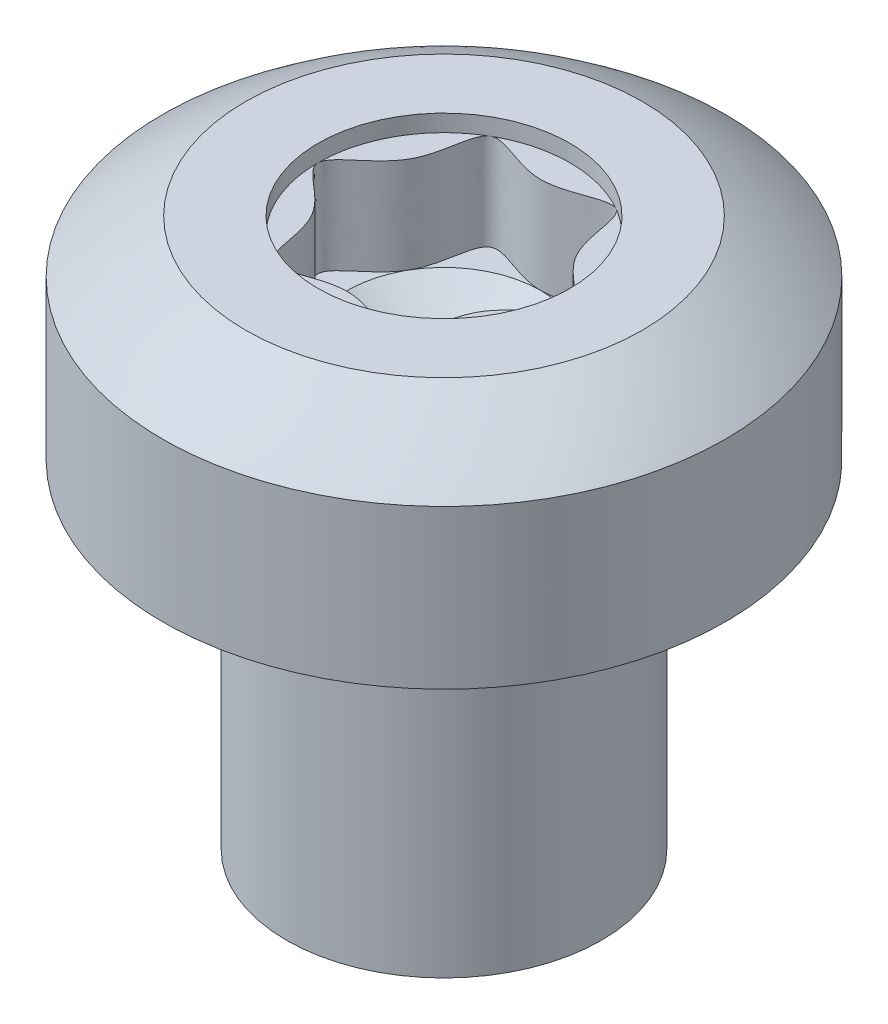
ISO-10303-21;
HEADER;
FILE_DESCRIPTION(('STEP AP214'),'2;1');
FILE_NAME('part.step','',(''),(''),'','','');
FILE_SCHEMA(('AUTOMOTIVE_DESIGN { 1 0 10303 214 1 1 1 1 }'));
ENDSEC;
DATA;
#1=APPLICATION_CONTEXT('core data for automotive mechanical design processes');
#2=APPLICATION_PROTOCOL_DEFINITION('international standard','automotive_design',2000,#1);
#3=PRODUCT_CONTEXT('',#1,'mechanical');
#4=PRODUCT('Part','Part','',(#3));
#5=PRODUCT_RELATED_PRODUCT_CATEGORY('part','',(#4));
#6=PRODUCT_DEFINITION_FORMATION('','',#4);
#7=PRODUCT_DEFINITION_CONTEXT('part definition',#1,'design');
#8=PRODUCT_DEFINITION('design','',#6,#7);
#9=PRODUCT_DEFINITION_SHAPE('','',#8);
#10=(LENGTH_UNIT() NAMED_UNIT(*) SI_UNIT(.MILLI.,.METRE.));
#11=(NAMED_UNIT(*) PLANE_ANGLE_UNIT() SI_UNIT($,.RADIAN.));
#12=(NAMED_UNIT(*) SI_UNIT($,.STERADIAN.) SOLID_ANGLE_UNIT());
#13=UNCERTAINTY_MEASURE_WITH_UNIT(LENGTH_MEASURE(1.E-05),#10,'distance_accuracy_value','');
#14=(GEOMETRIC_REPRESENTATION_CONTEXT(3) GLOBAL_UNCERTAINTY_ASSIGNED_CONTEXT((#13)) GLOBAL_UNIT_ASSIGNED_CONTEXT((#10,
#11,#12)) REPRESENTATION_CONTEXT('',''));
#15=CARTESIAN_POINT('',(0.,0.,0.));
#16=DIRECTION('',(0.,0.,1.));
#17=DIRECTION('',(1.,0.,0.));
#18=AXIS2_PLACEMENT_3D('',#15,#16,#17);
#19=CARTESIAN_POINT('',(0.,0.,0.));
#20=DIRECTION('',(0.,-1.,0.));
#21=DIRECTION('',(0.,0.,-1.));
#22=AXIS2_PLACEMENT_3D('',#19,#20,#21);
#23=CYLINDRICAL_SURFACE('',#22,10.);
#24=CARTESIAN_POINT('',(0.,12.,0.));
#25=DIRECTION('',(0.,-1.,0.));
#26=DIRECTION('',(0.,0.,-1.));
#27=AXIS2_PLACEMENT_3D('',#24,#25,#26);
#28=CIRCLE('',#27,10.);
#29=CARTESIAN_POINT('',(0.,12.,-10.));
#30=VERTEX_POINT('',#29);
#31=EDGE_CURVE('E150',#30,#30,#28,.T.);
#32=ORIENTED_EDGE('',*,*,#31,.F.);
#33=EDGE_LOOP('',(#32));
#34=FACE_BOUND('',#33,.T.);
#35=CARTESIAN_POINT('',(0.,17.625,0.));
#36=DIRECTION('',(0.,-1.,0.));
#37=DIRECTION('',(0.,0.,-1.));
#38=AXIS2_PLACEMENT_3D('',#35,#36,#37);
#39=CIRCLE('',#38,10.);
#40=CARTESIAN_POINT('',(10.,17.625,0.));
#41=VERTEX_POINT('',#40);
#42=EDGE_CURVE('E155',#41,#41,#39,.T.);
#43=ORIENTED_EDGE('',*,*,#42,.T.);
#44=EDGE_LOOP('',(#43));
#45=FACE_BOUND('',#44,.T.);
#46=ADVANCED_FACE('F34',(#34,#45),#23,.T.);
#47=CARTESIAN_POINT('',(5.6,12.,0.));
#48=DIRECTION('',(0.,-1.,0.));
#49=DIRECTION('',(0.,0.,-1.));
#50=AXIS2_PLACEMENT_3D('',#47,#48,#49);
#51=PLANE('',#50);
#52=ORIENTED_EDGE('',*,*,#31,.T.);
#53=EDGE_LOOP('',(#52));
#54=FACE_BOUND('',#53,.T.);
#55=CARTESIAN_POINT('',(0.,12.,0.));
#56=DIRECTION('',(0.,-1.,0.));
#57=DIRECTION('',(0.,0.,-1.));
#58=AXIS2_PLACEMENT_3D('',#55,#56,#57);
#59=CIRCLE('',#58,5.6);
#60=CARTESIAN_POINT('',(0.,12.,-5.6));
#61=VERTEX_POINT('',#60);
#62=EDGE_CURVE('E347',#61,#61,#59,.T.);
#63=ORIENTED_EDGE('',*,*,#62,.F.);
#64=EDGE_LOOP('',(#63));
#65=FACE_BOUND('',#64,.T.);
#66=ADVANCED_FACE('F316',(#54,#65),#51,.T.);
#67=CARTESIAN_POINT('',(0.,5.1350040032032,0.));
#68=DIRECTION('',(0.,-1.,0.));
#69=DIRECTION('',(1.,0.,0.));
#70=AXIS2_PLACEMENT_3D('',#67,#68,#69);
#71=SPHERICAL_SURFACE('',#70,16.);
#72=CARTESIAN_POINT('',(0.,19.5,0.));
#73=DIRECTION('',(0.,1.,0.));
#74=DIRECTION('',(0.,0.,1.));
#75=AXIS2_PLACEMENT_3D('',#72,#73,#74);
#76=CIRCLE('',#75,7.04605492541834);
#77=CARTESIAN_POINT('',(7.04605492541835,19.5,0.));
#78=VERTEX_POINT('',#77);
#79=EDGE_CURVE('E159',#78,#78,#76,.T.);
#80=CARTESIAN_POINT('',(10.,17.625,0.));
#81=CARTESIAN_POINT('',(9.97149270465613,17.6478241055635,0.));
#82=CARTESIAN_POINT('',(9.94290726578981,17.6705506098588,0.));
#83=CARTESIAN_POINT('',(9.88558144695234,17.7158073576517,0.));
#84=CARTESIAN_POINT('',(9.8568410669812,17.7383376011494,0.));
#85=CARTESIAN_POINT('',(9.79920671187419,17.7832007690856,0.));
#86=CARTESIAN_POINT('',(9.77031273673832,17.8055336935242,0.));
#87=CARTESIAN_POINT('',(9.71237254638966,17.8500011767979,0.));
#88=CARTESIAN_POINT('',(9.68332633117685,17.8721357356331,0.));
#89=CARTESIAN_POINT('',(9.62508302237821,17.9162054497948,0.));
#90=CARTESIAN_POINT('',(9.59588592879238,17.9381406051215,0.));
#91=CARTESIAN_POINT('',(9.53734223216518,17.9818104838873,0.));
#92=CARTESIAN_POINT('',(9.50799562912382,18.0035452073265,0.));
#93=CARTESIAN_POINT('',(9.44915428947527,18.0468132032881,0.));
#94=CARTESIAN_POINT('',(9.4196595528681,18.0683464758106,0.));
#95=CARTESIAN_POINT('',(9.36052332893282,18.1112105603669,0.));
#96=CARTESIAN_POINT('',(9.33088184160473,18.1325413724009,0.));
#97=CARTESIAN_POINT('',(9.27145350595016,18.1749995358975,0.));
#98=CARTESIAN_POINT('',(9.24166665762369,18.1961268873602,0.));
#99=CARTESIAN_POINT('',(9.18194899651077,18.2381771391713,0.));
#100=CARTESIAN_POINT('',(9.15201818372432,18.2591000395198,0.));
#101=CARTESIAN_POINT('',(9.09201399697936,18.3007404081451,0.));
#102=CARTESIAN_POINT('',(9.06194062302084,18.321457876422,0.));
#103=CARTESIAN_POINT('',(9.0016527239036,18.3626864095781,0.));
#104=CARTESIAN_POINT('',(8.97143819874488,18.3831974744574,0.));
#105=CARTESIAN_POINT('',(8.91086941381683,18.4240122391697,0.));
#106=CARTESIAN_POINT('',(8.88051515404752,18.4443159390027,0.));
#107=CARTESIAN_POINT('',(8.8196683230393,18.4847150216956,0.));
#108=CARTESIAN_POINT('',(8.7891757518004,18.5048104045557,0.));
#109=CARTESIAN_POINT('',(8.72805372747866,18.544791911143,0.));
#110=CARTESIAN_POINT('',(8.69742427439582,18.5646780348702,0.));
#111=CARTESIAN_POINT('',(8.63602992242947,18.6042400908432,0.));
#112=CARTESIAN_POINT('',(8.60526502354596,18.6239160230889,0.));
#113=CARTESIAN_POINT('',(8.54360122237185,18.6630567736047,0.));
#114=CARTESIAN_POINT('',(8.51270232008124,18.6825215918748,0.));
#115=CARTESIAN_POINT('',(8.45077196076916,18.721239201843,0.));
#116=CARTESIAN_POINT('',(8.41974050374768,18.7404919935412,0.));
#117=CARTESIAN_POINT('',(8.35754648986485,18.7787846477104,0.));
#118=CARTESIAN_POINT('',(8.32638393300349,18.7978245101814,0.));
#119=CARTESIAN_POINT('',(8.26392918047841,18.8356904132237,0.));
#120=CARTESIAN_POINT('',(8.23263698481468,18.854516453795,0.));
#121=CARTESIAN_POINT('',(8.16992442180042,18.8919538303906,0.));
#122=CARTESIAN_POINT('',(8.13850405444988,18.9105651664148,0.));
#123=CARTESIAN_POINT('',(8.0755366211868,18.9475722613351,0.));
#124=CARTESIAN_POINT('',(8.04398955527426,18.9659680202311,0.));
#125=CARTESIAN_POINT('',(7.98077020395215,19.0025430984209,0.));
#126=CARTESIAN_POINT('',(7.94909791854259,19.0207224177147,0.));
#127=CARTESIAN_POINT('',(7.88562961316229,19.0568637643738,0.));
#128=CARTESIAN_POINT('',(7.85383359319157,19.0748257917391,0.));
#129=CARTESIAN_POINT('',(7.7901193094259,19.1105317124022,0.));
#130=CARTESIAN_POINT('',(7.75820104563095,19.1282756057001,0.));
#131=CARTESIAN_POINT('',(7.69424377068562,19.1635444263176,0.));
#132=CARTESIAN_POINT('',(7.66220475953524,19.1810693536372,0.));
#133=CARTESIAN_POINT('',(7.59800749200706,19.2158994206495,0.));
#134=CARTESIAN_POINT('',(7.56584923562926,19.2332045603423,0.));
#135=CARTESIAN_POINT('',(7.50141498537224,19.2675942407714,0.));
#136=CARTESIAN_POINT('',(7.46913899149301,19.2846787815077,0.));
#137=CARTESIAN_POINT('',(7.40447077945217,19.3186264629831,0.));
#138=CARTESIAN_POINT('',(7.37207856129056,19.3354896037221,0.));
#139=CARTESIAN_POINT('',(7.30717941945383,19.3689936947439,0.));
#140=CARTESIAN_POINT('',(7.27467249577871,19.3856346450267,0.));
#141=CARTESIAN_POINT('',(7.20954546668588,19.4186935743411,0.));
#142=CARTESIAN_POINT('',(7.17692536126817,19.4351115533728,0.));
#143=CARTESIAN_POINT('',(7.11157349917018,19.4677237726549,0.));
#144=CARTESIAN_POINT('',(7.0788417424899,19.4839180129053,0.));
#145=CARTESIAN_POINT('',(7.04605492541835,19.5,0.));
#146=B_SPLINE_CURVE_WITH_KNOTS('',3,(#80,#81,#82,#83,#84,#85,#86,#87,#88,#89,#90,#91,#92,#93,
#94,#95,#96,#97,#98,#99,#100,#101,#102,#103,#104,#105,#106,#107,#108,#109,#110,#111,#112,#113,
#114,#115,#116,#117,#118,#119,#120,#121,#122,#123,#124,#125,#126,#127,#128,#129,#130,#131,#132,
#133,#134,#135,#136,#137,#138,#139,#140,#141,#142,#143,#144,#145),.UNSPECIFIED.,.F.,.F.,(4,2,2,
2,2,2,2,2,2,2,2,2,2,2,2,2,2,2,2,2,2,2,2,2,2,2,2,2,2,2,2,2,4),(0.,0.109555484755968,
0.219110969511936,0.328666454267901,0.43822193902387,0.547777423779835,0.657332908535805,
0.766888393291771,0.876443878047737,0.985999362803705,1.09555484755967,1.20511033231564,
1.31466581707161,1.42422130182757,1.53377678658354,1.64333227133951,1.75288775609547,
1.86244324085144,1.97199872560741,2.08155421036337,2.19110969511934,2.30066517987531,
2.41022066463127,2.51977614938724,2.62933163414321,2.73888711889918,2.84844260365514,
2.95799808841111,3.06755357316708,3.17710905792304,3.28666454267901,3.39622002743498,
3.50577551219095),.UNSPECIFIED.);
#147=EDGE_CURVE('BSEAM322',#41,#78,#146,.T.);
#148=ORIENTED_EDGE('',*,*,#42,.F.);
#149=ORIENTED_EDGE('',*,*,#79,.F.);
#150=ORIENTED_EDGE('',*,*,#147,.T.);
#151=ORIENTED_EDGE('',*,*,#147,.F.);
#152=EDGE_LOOP('',(#148,#150,#149,#151));
#153=FACE_BOUND('',#152,.T.);
#154=ADVANCED_FACE('F322',(#153),#71,.T.);
#155=CARTESIAN_POINT('',(10.,19.5,0.));
#156=DIRECTION('',(0.,1.,0.));
#157=DIRECTION('',(0.,0.,1.));
#158=AXIS2_PLACEMENT_3D('',#155,#156,#157);
#159=PLANE('',#158);
#160=CARTESIAN_POINT('',(0.,19.5,0.));
#161=DIRECTION('',(0.,1.,0.));
#162=DIRECTION('',(0.,0.,1.));
#163=AXIS2_PLACEMENT_3D('',#160,#161,#162);
#164=CIRCLE('',#163,4.475);
#165=CARTESIAN_POINT('',(0.,19.5,4.475));
#166=VERTEX_POINT('',#165);
#167=EDGE_CURVE('E367',#166,#166,#164,.T.);
#168=ORIENTED_EDGE('',*,*,#167,.F.);
#169=EDGE_LOOP('',(#168));
#170=FACE_BOUND('',#169,.T.);
#171=ORIENTED_EDGE('',*,*,#79,.T.);
#172=EDGE_LOOP('',(#171));
#173=FACE_BOUND('',#172,.T.);
#174=ADVANCED_FACE('F328',(#170,#173),#159,.T.);
#175=CARTESIAN_POINT('',(0.,9.,0.));
#176=DIRECTION('',(0.,-1.,0.));
#177=DIRECTION('',(0.,0.,-1.));
#178=AXIS2_PLACEMENT_3D('',#175,#176,#177);
#179=CONICAL_SURFACE('',#178,5.6,0.0894369975081105);
#180=CARTESIAN_POINT('',(0.,11.6,0.));
#181=DIRECTION('',(0.,-1.,0.));
#182=DIRECTION('',(0.,0.,-1.));
#183=AXIS2_PLACEMENT_3D('',#180,#181,#182);
#184=CIRCLE('',#183,5.36684179904969);
#185=CARTESIAN_POINT('',(0.,11.6,-5.36684179904969));
#186=VERTEX_POINT('',#185);
#187=EDGE_CURVE('E344',#186,#186,#184,.T.);
#188=ORIENTED_EDGE('',*,*,#187,.T.);
#189=EDGE_LOOP('',(#188));
#190=FACE_BOUND('',#189,.T.);
#191=CARTESIAN_POINT('',(0.,9.,0.));
#192=DIRECTION('',(0.,-1.,0.));
#193=DIRECTION('',(0.,0.,-1.));
#194=AXIS2_PLACEMENT_3D('',#191,#192,#193);
#195=CIRCLE('',#194,5.6);
#196=CARTESIAN_POINT('',(0.,9.,-5.6));
#197=VERTEX_POINT('',#196);
#198=EDGE_CURVE('E162',#197,#197,#195,.T.);
#199=ORIENTED_EDGE('',*,*,#198,.F.);
#200=EDGE_LOOP('',(#199));
#201=FACE_BOUND('',#200,.T.);
#202=ADVANCED_FACE('F358',(#190,#201),#179,.T.);
#203=CARTESIAN_POINT('',(0.,11.6357271244451,0.));
#204=DIRECTION('',(0.,-1.,0.));
#205=DIRECTION('',(0.,0.,-1.));
#206=AXIS2_PLACEMENT_3D('',#203,#204,#205);
#207=TOROIDAL_SURFACE('',#206,5.7652430698545,0.4);
#208=ORIENTED_EDGE('',*,*,#62,.T.);
#209=EDGE_LOOP('',(#208));
#210=FACE_BOUND('',#209,.T.);
#211=ORIENTED_EDGE('',*,*,#187,.F.);
#212=EDGE_LOOP('',(#211));
#213=FACE_BOUND('',#212,.T.);
#214=ADVANCED_FACE('F339',(#210,#213),#207,.F.);
#215=CARTESIAN_POINT('',(0.,0.,0.));
#216=DIRECTION('',(0.,-1.,0.));
#217=DIRECTION('',(0.,0.,-1.));
#218=AXIS2_PLACEMENT_3D('',#215,#216,#217);
#219=PLANE('',#218);
#220=CARTESIAN_POINT('',(0.,0.,0.));
#221=DIRECTION('',(0.,-1.,0.));
#222=DIRECTION('',(0.,0.,-1.));
#223=AXIS2_PLACEMENT_3D('',#220,#221,#222);
#224=CIRCLE('',#223,5.6);
#225=CARTESIAN_POINT('',(0.,0.,-5.6));
#226=VERTEX_POINT('',#225);
#227=EDGE_CURVE('E145',#226,#226,#224,.T.);
#228=ORIENTED_EDGE('',*,*,#227,.T.);
#229=EDGE_LOOP('',(#228));
#230=FACE_BOUND('',#229,.T.);
#231=ADVANCED_FACE('F36',(#230),#219,.T.);
#232=CARTESIAN_POINT('',(0.,0.,0.));
#233=DIRECTION('',(0.,-1.,0.));
#234=DIRECTION('',(0.,0.,-1.));
#235=AXIS2_PLACEMENT_3D('',#232,#233,#234);
#236=CYLINDRICAL_SURFACE('',#235,5.6);
#237=ORIENTED_EDGE('',*,*,#227,.F.);
#238=EDGE_LOOP('',(#237));
#239=FACE_BOUND('',#238,.T.);
#240=ORIENTED_EDGE('',*,*,#198,.T.);
#241=EDGE_LOOP('',(#240));
#242=FACE_BOUND('',#241,.T.);
#243=ADVANCED_FACE('F330',(#239,#242),#236,.T.);
#244=CARTESIAN_POINT('',(0.,18.897,0.));
#245=DIRECTION('',(0.,1.,0.));
#246=DIRECTION('',(0.,0.,1.));
#247=AXIS2_PLACEMENT_3D('',#244,#245,#246);
#248=CYLINDRICAL_SURFACE('',#247,4.475);
#249=ORIENTED_EDGE('',*,*,#167,.T.);
#250=EDGE_LOOP('',(#249));
#251=FACE_BOUND('',#250,.T.);
#252=CARTESIAN_POINT('',(0.,18.897,0.));
#253=DIRECTION('',(0.,1.,0.));
#254=DIRECTION('',(0.,0.,1.));
#255=AXIS2_PLACEMENT_3D('',#252,#253,#254);
#256=CIRCLE('',#255,4.475);
#257=CARTESIAN_POINT('',(-2.23749999999998,18.897,3.87546368193537));
#258=VERTEX_POINT('',#257);
#259=CARTESIAN_POINT('',(2.23750000000002,18.897,3.87546368193535));
#260=VERTEX_POINT('',#259);
#261=EDGE_CURVE('E126',#258,#260,#256,.T.);
#262=ORIENTED_EDGE('',*,*,#261,.F.);
#263=CARTESIAN_POINT('',(-4.475,18.897,0.));
#264=VERTEX_POINT('',#263);
#265=EDGE_CURVE('E368',#264,#258,#256,.T.);
#266=ORIENTED_EDGE('',*,*,#265,.F.);
#267=CARTESIAN_POINT('',(-2.23750000000002,18.897,-3.87546368193535));
#268=VERTEX_POINT('',#267);
#269=EDGE_CURVE('E370',#268,#264,#256,.T.);
#270=ORIENTED_EDGE('',*,*,#269,.F.);
#271=CARTESIAN_POINT('',(2.23749999999998,18.897,-3.87546368193537));
#272=VERTEX_POINT('',#271);
#273=EDGE_CURVE('E119',#272,#268,#256,.T.);
#274=ORIENTED_EDGE('',*,*,#273,.F.);
#275=CARTESIAN_POINT('',(4.475,18.897,0.));
#276=VERTEX_POINT('',#275);
#277=EDGE_CURVE('E109',#276,#272,#256,.T.);
#278=ORIENTED_EDGE('',*,*,#277,.F.);
#279=EDGE_CURVE('E52',#260,#276,#256,.T.);
#280=ORIENTED_EDGE('',*,*,#279,.F.);
#281=EDGE_LOOP('',(#262,#266,#270,#274,#278,#280));
#282=FACE_BOUND('',#281,.T.);
#283=ADVANCED_FACE('F116',(#251,#282),#248,.F.);
#284=CARTESIAN_POINT('',(0.,18.897,0.));
#285=DIRECTION('',(0.,1.,0.));
#286=DIRECTION('',(0.,0.,1.));
#287=AXIS2_PLACEMENT_3D('',#284,#285,#286);
#288=PLANE('',#287);
#289=CARTESIAN_POINT('',(0.,18.897,3.44230769230769));
#290=CARTESIAN_POINT('',(0.918288321664463,18.897,3.44230769230768));
#291=CARTESIAN_POINT('',(2.75486496499339,18.897,4.77156608735995));
#292=CARTESIAN_POINT('',(2.40554014002656,18.897,1.38883924739077));
#293=CARTESIAN_POINT('',(5.50972992998672,18.897,0.));
#294=CARTESIAN_POINT('',(2.40554014002654,18.897,-1.38883924739079));
#295=CARTESIAN_POINT('',(2.75486496499334,18.897,-4.77156608735997));
#296=CARTESIAN_POINT('',(0.,18.897,-2.77767849478156));
#297=CARTESIAN_POINT('',(-2.75486496499339,18.897,-4.77156608735995));
#298=CARTESIAN_POINT('',(-2.40554014002655,18.897,-1.38883924739077));
#299=CARTESIAN_POINT('',(-5.50972992998672,18.897,0.));
#300=CARTESIAN_POINT('',(-2.40554014002654,18.897,1.38883924739079));
#301=CARTESIAN_POINT('',(-2.75486496499334,18.897,4.77156608735997));
#302=CARTESIAN_POINT('',(-0.918288321664446,18.897,3.4423076923077));
#303=CARTESIAN_POINT('',(0.,18.897,3.44230769230769));
#304=B_SPLINE_CURVE_WITH_KNOTS('',3,(#289,#290,#291,#292,#293,#294,#295,#296,#297,#298,#299,
#300,#301,#302,#303),.UNSPECIFIED.,.T.,.F.,(4,1,1,1,1,1,1,1,1,1,1,1,4),(0.,0.0833333333333341,
0.166666666666667,0.250000000000001,0.333333333333333,0.416666666666667,0.5,0.583333333333334,
0.666666666666667,0.750000000000001,0.833333333333333,0.916666666666667,1.),.UNSPECIFIED.);
#305=EDGE_CURVE('E11',#258,#264,#304,.F.);
#306=ORIENTED_EDGE('',*,*,#305,.T.);
#307=ORIENTED_EDGE('',*,*,#265,.T.);
#308=EDGE_LOOP('',(#306,#307));
#309=FACE_BOUND('',#308,.T.);
#310=ADVANCED_FACE('F337',(#309),#288,.T.);
#311=EDGE_CURVE('E45',#264,#268,#304,.F.);
#312=ORIENTED_EDGE('',*,*,#311,.T.);
#313=ORIENTED_EDGE('',*,*,#269,.T.);
#314=EDGE_LOOP('',(#312,#313));
#315=FACE_BOUND('',#314,.T.);
#316=ADVANCED_FACE('F378',(#315),#288,.T.);
#317=EDGE_CURVE('E113',#268,#272,#304,.F.);
#318=ORIENTED_EDGE('',*,*,#317,.T.);
#319=ORIENTED_EDGE('',*,*,#273,.T.);
#320=EDGE_LOOP('',(#318,#319));
#321=FACE_BOUND('',#320,.T.);
#322=ADVANCED_FACE('F377',(#321),#288,.T.);
#323=EDGE_CURVE('E107',#272,#276,#304,.F.);
#324=ORIENTED_EDGE('',*,*,#323,.T.);
#325=ORIENTED_EDGE('',*,*,#277,.T.);
#326=EDGE_LOOP('',(#324,#325));
#327=FACE_BOUND('',#326,.T.);
#328=ADVANCED_FACE('F108',(#327),#288,.T.);
#329=EDGE_CURVE('E114',#276,#260,#304,.F.);
#330=ORIENTED_EDGE('',*,*,#329,.T.);
#331=ORIENTED_EDGE('',*,*,#279,.T.);
#332=EDGE_LOOP('',(#330,#331));
#333=FACE_BOUND('',#332,.T.);
#334=ADVANCED_FACE('F123',(#333),#288,.T.);
#335=EDGE_CURVE('E38',#260,#258,#304,.F.);
#336=ORIENTED_EDGE('',*,*,#335,.T.);
#337=ORIENTED_EDGE('',*,*,#261,.T.);
#338=EDGE_LOOP('',(#336,#337));
#339=FACE_BOUND('',#338,.T.);
#340=ADVANCED_FACE('F385',(#339),#288,.T.);
#341=CARTESIAN_POINT('',(0.,15.48,0.));
#342=DIRECTION('',(0.,1.,0.));
#343=DIRECTION('',(0.,0.,1.));
#344=AXIS2_PLACEMENT_3D('',#341,#342,#343);
#345=PLANE('',#344);
#346=CARTESIAN_POINT('',(0.,15.48,0.));
#347=DIRECTION('',(0.,1.,0.));
#348=DIRECTION('',(0.881549972315596,0.,0.472090718305679));
#349=AXIS2_PLACEMENT_3D('',#346,#347,#348);
#350=CIRCLE('',#349,3.44230769230769);
#351=CARTESIAN_POINT('',(3.03722909217421,15.48,1.62678909538513));
#352=VERTEX_POINT('',#351);
#353=CARTESIAN_POINT('',(2.99677549755158,15.48,-1.6958986501878));
#354=VERTEX_POINT('',#353);
#355=EDGE_CURVE('E139',#352,#354,#350,.T.);
#356=ORIENTED_EDGE('',*,*,#355,.F.);
#357=CARTESIAN_POINT('',(2.99617375225329,15.48,-1.69554974852651));
#358=CARTESIAN_POINT('',(3.46245928990236,15.48,-0.915911396191941));
#359=CARTESIAN_POINT('',(5.45780527060595,15.48,-0.0134488557495299));
#360=CARTESIAN_POINT('',(3.52105692363944,15.48,0.889013684692909));
#361=CARTESIAN_POINT('',(3.03862803092515,15.48,1.62768660743324));
#362=B_SPLINE_CURVE_WITH_KNOTS('',3,(#357,#358,#359,#360,#361),.UNSPECIFIED.,.F.,.F.,(4,1,4),
(0.16998590852369,0.252420880561729,0.33243497203804),.UNSPECIFIED.);
#363=EDGE_CURVE('E283',#352,#354,#362,.F.);
#364=ORIENTED_EDGE('',*,*,#363,.T.);
#365=EDGE_LOOP('',(#356,#364));
#366=FACE_BOUND('',#365,.T.);
#367=ADVANCED_FACE('F183',(#366),#345,.T.);
#368=CARTESIAN_POINT('',(-0.000834163831890233,15.48,-3.44230723189605));
#369=CARTESIAN_POINT('',(0.904510065186351,15.48,-3.44253296503183));
#370=CARTESIAN_POINT('',(1.69486830878059,15.48,-2.99666399821082));
#371=CARTESIAN_POINT('',(2.48178588688751,15.48,-2.55273603216818));
#372=CARTESIAN_POINT('',(2.94889642106293,15.48,-1.77695626320178));
#373=B_SPLINE_CURVE_WITH_KNOTS('',2,(#368,#369,#370,#371,#372),.UNSPECIFIED.,.F.,.F.,(3,2,3),
(0.,0.5,1.),.UNSPECIFIED.);
#374=CARTESIAN_POINT('',(0.00078067086874241,15.48,-3.44230777542332));
#375=VERTEX_POINT('',#374);
#376=CARTESIAN_POINT('',(2.94789638314828,15.48,-1.77987821042572));
#377=VERTEX_POINT('',#376);
#378=EDGE_CURVE('E125',#375,#377,#373,.T.);
#379=ORIENTED_EDGE('',*,*,#378,.T.);
#380=CARTESIAN_POINT('',(0.000157820394540302,15.48,-3.44230769885114));
#381=CARTESIAN_POINT('',(0.918393533562931,15.48,-3.44238383977239));
#382=CARTESIAN_POINT('',(2.72955419007982,15.48,-4.75318797232874));
#383=CARTESIAN_POINT('',(2.52800635231039,15.48,-2.57787873195569));
#384=CARTESIAN_POINT('',(2.94445689999658,15.48,-1.78762930042764));
#385=B_SPLINE_CURVE_WITH_KNOTS('',3,(#380,#381,#382,#383,#384),.UNSPECIFIED.,.F.,.F.,(4,1,4),
(0.335629718209263,0.418958277551958,0.499995226009362),.UNSPECIFIED.);
#386=EDGE_CURVE('E280',#377,#375,#385,.F.);
#387=ORIENTED_EDGE('',*,*,#386,.T.);
#388=EDGE_LOOP('',(#379,#387));
#389=FACE_BOUND('',#388,.T.);
#390=ADVANCED_FACE('F172',(#389),#345,.T.);
#391=CARTESIAN_POINT('',(0.,15.48,0.));
#392=DIRECTION('',(0.,1.,0.));
#393=DIRECTION('',(0.000226787078829839,0.,-0.99999997428381));
#394=AXIS2_PLACEMENT_3D('',#391,#392,#393);
#395=CIRCLE('',#394,3.44230769230769);
#396=CARTESIAN_POINT('',(-3.00170686449087,15.48,-1.68749221491062));
#397=VERTEX_POINT('',#396);
#398=EDGE_CURVE('E142',#375,#397,#395,.T.);
#399=ORIENTED_EDGE('',*,*,#398,.F.);
#400=CARTESIAN_POINT('',(-3.00123902658588,15.48,-1.68712854922987));
#401=CARTESIAN_POINT('',(-2.99441934326545,15.48,-1.69840256390893));
#402=CARTESIAN_POINT('',(-2.52031112633633,15.48,-2.50023720164921));
#403=CARTESIAN_POINT('',(-2.75486496499339,15.48,-4.77156608735995));
#404=CARTESIAN_POINT('',(-0.918235714866251,15.48,-3.44226961710488));
#405=CARTESIAN_POINT('',(0.00010521359642264,15.48,-3.44230769448894));
#406=CARTESIAN_POINT('',(0.000157820394536694,15.48,-3.44230769885114));
#407=B_SPLINE_CURVE_WITH_KNOTS('',3,(#400,#401,#402,#403,#404,#405,#406),.UNSPECIFIED.,.F.,.F.,
(4,1,1,1,4),(0.499995226009362,0.501190833859919,0.584524167193251,0.667857500526585,
0.667862274517224),.UNSPECIFIED.);
#408=EDGE_CURVE('E282',#375,#397,#407,.F.);
#409=ORIENTED_EDGE('',*,*,#408,.T.);
#410=EDGE_LOOP('',(#399,#409));
#411=FACE_BOUND('',#410,.T.);
#412=ADVANCED_FACE('F182',(#411),#345,.T.);
#413=CARTESIAN_POINT('',(0.,15.48,0.));
#414=DIRECTION('',(0.,1.,0.));
#415=DIRECTION('',(-0.88155332130389,0.,-0.472084464580312));
#416=AXIS2_PLACEMENT_3D('',#413,#414,#415);
#417=CIRCLE('',#416,3.44230769230769);
#418=CARTESIAN_POINT('',(-3.03724142111351,15.48,-1.62676812201168));
#419=VERTEX_POINT('',#418);
#420=CARTESIAN_POINT('',(-2.99677549755226,15.48,1.69589865018661));
#421=VERTEX_POINT('',#420);
#422=EDGE_CURVE('E129',#419,#421,#417,.T.);
#423=ORIENTED_EDGE('',*,*,#422,.F.);
#424=CARTESIAN_POINT('',(-2.99617375225399,15.48,1.69554974852534));
#425=CARTESIAN_POINT('',(-3.46245928990338,15.48,0.915911396191481));
#426=CARTESIAN_POINT('',(-5.4577962500416,15.48,0.013452935603652));
#427=CARTESIAN_POINT('',(-3.52107443487022,15.48,-0.889005524984209));
#428=CARTESIAN_POINT('',(-3.03864131479675,15.48,-1.62766626803707));
#429=B_SPLINE_CURVE_WITH_KNOTS('',3,(#424,#425,#426,#427,#428),.UNSPECIFIED.,.F.,.F.,(4,1,4),
(0.669986642923722,0.75242161496172,0.832434972037998),.UNSPECIFIED.);
#430=EDGE_CURVE('E234',#419,#421,#429,.F.);
#431=ORIENTED_EDGE('',*,*,#430,.T.);
#432=EDGE_LOOP('',(#423,#431));
#433=FACE_BOUND('',#432,.T.);
#434=ADVANCED_FACE('F185',(#433),#345,.T.);
#435=CARTESIAN_POINT('',(0.,15.48,0.));
#436=DIRECTION('',(0.,1.,0.));
#437=DIRECTION('',(-0.85651515210874,0.,0.516121879218603));
#438=AXIS2_PLACEMENT_3D('',#435,#436,#437);
#439=CIRCLE('',#438,3.44230769230769);
#440=CARTESIAN_POINT('',(-2.94789638314791,15.48,1.77987821042638));
#441=VERTEX_POINT('',#440);
#442=CARTESIAN_POINT('',(-0.00118872340266294,15.48,3.44230736338173));
#443=VERTEX_POINT('',#442);
#444=EDGE_CURVE('E131',#441,#443,#439,.T.);
#445=ORIENTED_EDGE('',*,*,#444,.F.);
#446=CARTESIAN_POINT('',(-0.000723309883971654,15.48,3.44230782973074));
#447=CARTESIAN_POINT('',(-0.91877049259476,15.48,3.44265663702227));
#448=CARTESIAN_POINT('',(-2.72953321467094,15.48,4.75296158438182));
#449=CARTESIAN_POINT('',(-2.52800635231034,15.48,2.57787873195517));
#450=CARTESIAN_POINT('',(-2.94445689999688,15.48,1.78762930042707));
#451=B_SPLINE_CURVE_WITH_KNOTS('',3,(#446,#447,#448,#449,#450),.UNSPECIFIED.,.F.,.F.,(4,1,4),
(0.835629718209244,0.918941171767992,0.999978120225415),.UNSPECIFIED.);
#452=EDGE_CURVE('E276',#441,#443,#451,.F.);
#453=ORIENTED_EDGE('',*,*,#452,.T.);
#454=EDGE_LOOP('',(#445,#453));
#455=FACE_BOUND('',#454,.T.);
#456=ADVANCED_FACE('F308',(#455),#345,.T.);
#457=CARTESIAN_POINT('',(0.,15.48,0.));
#458=DIRECTION('',(0.,1.,0.));
#459=DIRECTION('',(-0.000451153900399772,0.,0.999999898230074));
#460=AXIS2_PLACEMENT_3D('',#457,#458,#459);
#461=CIRCLE('',#460,3.44230769230769);
#462=CARTESIAN_POINT('',(3.00170686449026,15.48,1.68749221491164));
#463=VERTEX_POINT('',#462);
#464=EDGE_CURVE('E135',#443,#463,#461,.T.);
#465=ORIENTED_EDGE('',*,*,#464,.F.);
#466=CARTESIAN_POINT('',(3.00123902658527,15.48,1.68712854923089));
#467=CARTESIAN_POINT('',(2.98626334201144,15.48,1.7118570638376));
#468=CARTESIAN_POINT('',(2.9718702665109,15.48,1.73693301936167));
#469=CARTESIAN_POINT('',(2.94418456063017,15.48,1.78770001829371));
#470=CARTESIAN_POINT('',(2.93089240659233,15.48,1.81339132181409));
#471=CARTESIAN_POINT('',(2.90534465239129,15.48,1.86531198181117));
#472=CARTESIAN_POINT('',(2.89309003064763,15.48,1.89154181780911));
#473=CARTESIAN_POINT('',(2.86954731646755,15.48,1.94446295480991));
#474=CARTESIAN_POINT('',(2.85826023431638,15.48,1.97115470401707));
#475=CARTESIAN_POINT('',(2.83658469822732,15.48,2.02492341185037));
#476=CARTESIAN_POINT('',(2.82619694101172,15.48,2.05200065054326));
#477=CARTESIAN_POINT('',(2.80625243388724,15.48,2.1064635662698));
#478=CARTESIAN_POINT('',(2.79669583466416,15.48,2.13384929821981));
#479=CARTESIAN_POINT('',(2.7691903631698,15.48,2.21629389719808));
#480=CARTESIAN_POINT('',(2.7523699958519,15.48,2.27173067318761));
#481=CARTESIAN_POINT('',(2.72124891265514,15.48,2.38291037620042));
#482=CARTESIAN_POINT('',(2.70693276981264,15.48,2.43864907750447));
#483=CARTESIAN_POINT('',(2.68027584485958,15.48,2.54983068363604));
#484=CARTESIAN_POINT('',(2.66791192270816,15.48,2.60526810010125));
#485=CARTESIAN_POINT('',(2.63347291535123,15.48,2.76802337897613));
#486=CARTESIAN_POINT('',(2.61305002232429,15.48,2.87568072508239));
#487=CARTESIAN_POINT('',(2.582816775495,15.48,3.03419580050415));
#488=CARTESIAN_POINT('',(2.57308789446365,15.48,3.08507567000115));
#489=CARTESIAN_POINT('',(2.55338711914005,15.48,3.18409308456168));
#490=CARTESIAN_POINT('',(2.54345301390257,15.48,3.23223797005103));
#491=CARTESIAN_POINT('',(2.52276280072507,15.48,3.32517739284668));
#492=CARTESIAN_POINT('',(2.51209827998078,15.48,3.36999142596487));
#493=CARTESIAN_POINT('',(2.49467049669073,15.48,3.43550346631273));
#494=CARTESIAN_POINT('',(2.48882015691146,15.48,3.45644227928129));
#495=CARTESIAN_POINT('',(2.47669668228018,15.48,3.4972457483071));
#496=CARTESIAN_POINT('',(2.47045155184852,15.48,3.51711863743505));
#497=CARTESIAN_POINT('',(2.45746518832386,15.48,3.55571107358314));
#498=CARTESIAN_POINT('',(2.45075891094112,15.48,3.57444228757807));
#499=CARTESIAN_POINT('',(2.43677329505146,15.48,3.61067364561121));
#500=CARTESIAN_POINT('',(2.42953646960801,15.48,3.62818992965075));
#501=CARTESIAN_POINT('',(2.41805146678354,15.48,3.65379488297629));
#502=CARTESIAN_POINT('',(2.41419965879975,15.48,3.66206184268359));
#503=CARTESIAN_POINT('',(2.40633042755904,15.48,3.67825878567278));
#504=CARTESIAN_POINT('',(2.40231968031867,15.48,3.68619199822358));
#505=CARTESIAN_POINT('',(2.39412389652741,15.48,3.70171134980725));
#506=CARTESIAN_POINT('',(2.38994587954711,15.48,3.70930118556781));
#507=CARTESIAN_POINT('',(2.38140659905237,15.48,3.72412377432552));
#508=CARTESIAN_POINT('',(2.37705261207373,15.48,3.73136070560123));
#509=CARTESIAN_POINT('',(2.36815264292948,15.48,3.74546742095002));
#510=CARTESIAN_POINT('',(2.36361405966617,15.48,3.75234185838665));
#511=CARTESIAN_POINT('',(2.35433622074609,15.48,3.76571359045458));
#512=CARTESIAN_POINT('',(2.34960431587684,15.48,3.77221596760076));
#513=CARTESIAN_POINT('',(2.33993152871296,15.48,3.78483346522043));
#514=CARTESIAN_POINT('',(2.33499773230613,15.48,3.79095400452561));
#515=CARTESIAN_POINT('',(2.32491244214072,15.48,3.80279843756662));
#516=CARTESIAN_POINT('',(2.31976753600261,15.48,3.80852790809395));
#517=CARTESIAN_POINT('',(2.31184687329423,15.48,3.81685330584854));
#518=CARTESIAN_POINT('',(2.30919236265737,15.48,3.81956526775517));
#519=CARTESIAN_POINT('',(2.30382687565399,15.48,3.82488706173361));
#520=CARTESIAN_POINT('',(2.3011165634185,15.48,3.82749756174608));
#521=CARTESIAN_POINT('',(2.29563854932791,15.48,3.83261516366761));
#522=CARTESIAN_POINT('',(2.29287144197949,15.48,3.83512290178036));
#523=CARTESIAN_POINT('',(2.28727882328109,15.48,3.84003384395842));
#524=CARTESIAN_POINT('',(2.28445383046036,15.48,3.84243763805872));
#525=CARTESIAN_POINT('',(2.27874445932655,15.48,3.84713953798788));
#526=CARTESIAN_POINT('',(2.27586051727461,15.48,3.84943817323127));
#527=CARTESIAN_POINT('',(2.27003226621165,15.48,3.85392862585467));
#528=CARTESIAN_POINT('',(2.26708830648675,15.48,3.85612089630657));
#529=CARTESIAN_POINT('',(2.26113904144337,15.48,3.86039749844535));
#530=CARTESIAN_POINT('',(2.2581339953609,15.48,3.86248219056579));
#531=CARTESIAN_POINT('',(2.25206159428404,15.48,3.86654255027647));
#532=CARTESIAN_POINT('',(2.24899440729663,15.48,3.86851846900879));
#533=CARTESIAN_POINT('',(2.24279671345288,15.48,3.87236014497255));
#534=CARTESIAN_POINT('',(2.2396662844629,15.48,3.87422602776425));
#535=CARTESIAN_POINT('',(2.23334128963486,15.48,3.87784675835216));
#536=CARTESIAN_POINT('',(2.23014671500275,15.48,3.87960159078509));
#537=CARTESIAN_POINT('',(2.22369412889143,15.48,3.88300202565372));
#538=CARTESIAN_POINT('',(2.22043603301249,15.48,3.88464746784401));
#539=CARTESIAN_POINT('',(2.21385695297195,15.48,3.8878307501546));
#540=CARTESIAN_POINT('',(2.21053582378864,15.48,3.88936829038534));
#541=CARTESIAN_POINT('',(2.20383124534331,15.48,3.89233743767355));
#542=CARTESIAN_POINT('',(2.2004476050543,15.48,3.89376861306482));
#543=CARTESIAN_POINT('',(2.19361854926911,15.48,3.89652667834986));
#544=CARTESIAN_POINT('',(2.19017291028515,15.48,3.89785301440824));
#545=CARTESIAN_POINT('',(2.18322038824993,15.48,3.90040304239552));
#546=CARTESIAN_POINT('',(2.17971326156385,15.48,3.90162606943733));
#547=CARTESIAN_POINT('',(2.17263829284776,15.48,3.90397110662941));
#548=CARTESIAN_POINT('',(2.16907019797797,15.48,3.90509235294435));
#549=CARTESIAN_POINT('',(2.16187377190425,15.48,3.90723545028278));
#550=CARTESIAN_POINT('',(2.15824518769617,15.48,3.90825645129381));
#551=CARTESIAN_POINT('',(2.15092840113112,15.48,3.91020064222049));
#552=CARTESIAN_POINT('',(2.14723995460446,15.48,3.91112290867827));
#553=CARTESIAN_POINT('',(2.13603114636401,15.48,3.91375821063643));
#554=CARTESIAN_POINT('',(2.12847207995735,15.48,3.91530875046563));
#555=CARTESIAN_POINT('',(2.11312274557688,15.48,3.91804132769967));
#556=CARTESIAN_POINT('',(2.10533098124707,15.48,3.9192148184567));
#557=CARTESIAN_POINT('',(2.08951924637781,15.48,3.92120620294373));
#558=CARTESIAN_POINT('',(2.08149817000185,15.48,3.92201523151317));
#559=CARTESIAN_POINT('',(2.06523156489963,15.48,3.9232900343984));
#560=CARTESIAN_POINT('',(2.05698535330556,15.48,3.92374690981551));
#561=CARTESIAN_POINT('',(2.04027201112965,15.48,3.92432954344498));
#562=CARTESIAN_POINT('',(2.03180458943273,15.48,3.92444659634122));
#563=CARTESIAN_POINT('',(2.01465245656371,15.48,3.92436150340473));
#564=CARTESIAN_POINT('',(2.00596779821633,15.48,3.92415101093624));
#565=CARTESIAN_POINT('',(1.98838487601254,15.48,3.92342259056983));
#566=CARTESIAN_POINT('',(1.97948694868412,15.48,3.92289678749628));
#567=CARTESIAN_POINT('',(1.9614811849727,15.48,3.92154946439197));
#568=CARTESIAN_POINT('',(1.95237390511646,15.48,3.92072061205161));
#569=CARTESIAN_POINT('',(1.93395341721067,15.48,3.91877864415055));
#570=CARTESIAN_POINT('',(1.92464093234099,15.48,3.91765877022754));
#571=CARTESIAN_POINT('',(1.89604847428146,15.48,3.91384429012735));
#572=CARTESIAN_POINT('',(1.87682125877696,15.48,3.91075150387797));
#573=CARTESIAN_POINT('',(1.83758907953713,15.48,3.90359301143223));
#574=CARTESIAN_POINT('',(1.81759160173228,15.48,3.89948740631634));
#575=CARTESIAN_POINT('',(1.77684921566324,15.48,3.89038946309224));
#576=CARTESIAN_POINT('',(1.75611147345133,15.48,3.88536538684271));
#577=CARTESIAN_POINT('',(1.69157080183252,15.48,3.86878618026894));
#578=CARTESIAN_POINT('',(1.64802640736765,15.48,3.85623425572672));
#579=CARTESIAN_POINT('',(1.55832960091115,15.48,3.82876695712466));
#580=CARTESIAN_POINT('',(1.51221027276693,15.48,3.81374725867701));
#581=CARTESIAN_POINT('',(1.41763239437089,15.48,3.78203687633452));
#582=CARTESIAN_POINT('',(1.36918964056409,15.48,3.7652997360932));
#583=CARTESIAN_POINT('',(1.21800298608011,15.48,3.71275935364456));
#584=CARTESIAN_POINT('',(1.11536219261423,15.48,3.67664942209264));
#585=CARTESIAN_POINT('',(0.958366650724256,15.48,3.62469685458981));
#586=CARTESIAN_POINT('',(0.90448685361383,15.48,3.60744673790541));
#587=CARTESIAN_POINT('',(0.795440388055692,15.48,3.57428889123788));
#588=CARTESIAN_POINT('',(0.740266472529786,15.48,3.55840478767709));
#589=CARTESIAN_POINT('',(0.628934735660043,15.48,3.52878085486052));
#590=CARTESIAN_POINT('',(0.572772789901603,15.48,3.515056192799));
#591=CARTESIAN_POINT('',(0.487984601559954,15.48,3.49666093849067));
#592=CARTESIAN_POINT('',(0.459596200089743,15.48,3.49088880675601));
#593=CARTESIAN_POINT('',(0.402656935620835,15.48,3.4801728376792));
#594=CARTESIAN_POINT('',(0.374106044460699,15.48,3.47522914873445));
#595=CARTESIAN_POINT('',(0.316874240317981,15.48,3.4662678051476));
#596=CARTESIAN_POINT('',(0.288193405825714,15.48,3.46224965215706));
#597=CARTESIAN_POINT('',(0.230733261615377,15.48,3.45523712101361));
#598=CARTESIAN_POINT('',(0.201954071791956,15.48,3.45224177085547));
#599=CARTESIAN_POINT('',(0.144330009598229,15.48,3.44737235901024));
#600=CARTESIAN_POINT('',(0.115485234560663,15.48,3.44549715318964));
#601=CARTESIAN_POINT('',(0.0577590872924768,15.48,3.44296525226624));
#602=CARTESIAN_POINT('',(0.0288777556063624,15.48,3.44230769265501));
#603=CARTESIAN_POINT('',(-6.02758336515206E-05,15.48,3.44230769230697));
#604=CARTESIAN_POINT('',(-0.000120551651723228,15.48,3.44230769517104));
#605=CARTESIAN_POINT('',(-0.000241103294900148,15.48,3.44230770662487));
#606=CARTESIAN_POINT('',(-0.000301379120005359,15.48,3.44230771521462));
#607=CARTESIAN_POINT('',(-0.000482206598106928,15.48,3.44230774957171));
#608=CARTESIAN_POINT('',(-0.000602758252269005,15.48,3.4423077839269));
#609=CARTESIAN_POINT('',(-0.000723309883975324,15.48,3.44230782973074));
#610=B_SPLINE_CURVE_WITH_KNOTS('',3,(#466,#467,#468,#469,#470,#471,#472,#473,#474,#475,#476,
#477,#478,#479,#480,#481,#482,#483,#484,#485,#486,#487,#488,#489,#490,#491,#492,#493,#494,#495,
#496,#497,#498,#499,#500,#501,#502,#503,#504,#505,#506,#507,#508,#509,#510,#511,#512,#513,#514,
#515,#516,#517,#518,#519,#520,#521,#522,#523,#524,#525,#526,#527,#528,#529,#530,#531,#532,#533,
#534,#535,#536,#537,#538,#539,#540,#541,#542,#543,#544,#545,#546,#547,#548,#549,#550,#551,#552,
#553,#554,#555,#556,#557,#558,#559,#560,#561,#562,#563,#564,#565,#566,#567,#568,#569,#570,#571,
#572,#573,#574,#575,#576,#577,#578,#579,#580,#581,#582,#583,#584,#585,#586,#587,#588,#589,#590,
#591,#592,#593,#594,#595,#596,#597,#598,#599,#600,#601,#602,#603,#604,#605,#606,#607,#608,#609),
.UNSPECIFIED.,.F.,.F.,(4,2,2,2,2,2,2,2,2,2,2,2,2,2,2,2,2,2,2,2,2,2,2,2,2,2,2,2,2,2,2,2,2,2,2,2,
2,2,2,2,2,2,2,2,2,2,2,2,2,2,2,2,2,2,2,2,2,2,2,2,2,2,2,2,2,2,2,2,2,2,2,4),(0.,0.0867144483681673,
0.173466222105657,0.260298914331497,0.347221198244563,0.434210230731115,0.521215001267746,
0.694932967201803,0.867539880190706,1.03791583855175,1.3666133338169,1.52201946814018,
1.66948850402192,1.80764051905938,1.87285410135064,1.93533392110618,1.99500305236427,
2.05182993670778,2.07918680998486,2.10585000378839,2.13183559645081,2.15716598831671,
2.18187070100677,2.20598720741493,2.22956175746815,2.25265014836726,2.26403344031138,
2.27532082932315,2.28652222843105,2.29764822572852,2.30871007989675,2.31971970892221,
2.33068967152293,2.34163314097166,2.35256387124297,2.36349611043624,2.37444402655916,
2.38542125467758,2.39644084142277,2.40751521272864,2.41865614926911,2.42987476944962,
2.44118151960064,2.45258617085629,2.47572274121899,2.49935180541663,2.52352812392134,
2.54829698637878,2.57369499062183,2.59975087098643,2.6264863264637,2.65391681528008,
2.6820522956081,2.74045038617082,2.80167968281829,2.86568197772671,3.00158000027681,
3.1470789043362,3.3008357314978,3.6272353292774,3.7969383488613,3.9691511993234,4.142524268481,
4.22942203409713,4.31633534894656,4.40320175595293,4.48998537951937,4.57668020864342,
4.66331346225577,4.66349428972916,4.66367511720332,4.66403677215648),.UNSPECIFIED.);
#611=EDGE_CURVE('E278',#443,#463,#610,.F.);
#612=ORIENTED_EDGE('',*,*,#611,.T.);
#613=EDGE_LOOP('',(#465,#612));
#614=FACE_BOUND('',#613,.T.);
#615=ADVANCED_FACE('F310',(#614),#345,.T.);
#616=CARTESIAN_POINT('',(0.,13.4925827272126,0.));
#617=DIRECTION('',(0.,1.,0.));
#618=DIRECTION('',(0.,0.,1.));
#619=AXIS2_PLACEMENT_3D('',#616,#617,#618);
#620=CONICAL_SURFACE('',#619,0.,1.04719755119659);
#621=ORIENTED_EDGE('',*,*,#378,.F.);
#622=ORIENTED_EDGE('',*,*,#398,.T.);
#623=CARTESIAN_POINT('',(-3.03864131479675,15.48,-1.62766626803707));
#624=CARTESIAN_POINT('',(-3.02583263239694,15.48,-1.64727783794241));
#625=CARTESIAN_POINT('',(-3.01335631051096,15.48,-1.66709676323295));
#626=CARTESIAN_POINT('',(-3.00123902658588,15.48,-1.68712854922987));
#627=B_SPLINE_CURVE_WITH_KNOTS('',3,(#623,#624,#625,#626),.UNSPECIFIED.,.F.,.F.,(4,4),
(0.667862274517224,0.669986642923722),.UNSPECIFIED.);
#628=EDGE_CURVE('E239',#397,#419,#627,.F.);
#629=ORIENTED_EDGE('',*,*,#628,.T.);
#630=ORIENTED_EDGE('',*,*,#422,.T.);
#631=CARTESIAN_POINT('',(-2.94445689999688,15.48,1.78762930042707));
#632=CARTESIAN_POINT('',(-2.95625806918546,15.48,1.76523560375781));
#633=CARTESIAN_POINT('',(-2.97325218778556,15.48,1.73439664940372));
#634=CARTESIAN_POINT('',(-2.99109225748008,15.48,1.70404610514171));
#635=CARTESIAN_POINT('',(-2.99617375225399,15.48,1.69554974852534));
#636=B_SPLINE_CURVE_WITH_KNOTS('',3,(#631,#632,#633,#634,#635),.UNSPECIFIED.,.F.,.F.,(4,1,4),
(0.832434972037999,0.834731356913909,0.835629718209244),.UNSPECIFIED.);
#637=EDGE_CURVE('E243',#421,#441,#636,.F.);
#638=ORIENTED_EDGE('',*,*,#637,.T.);
#639=ORIENTED_EDGE('',*,*,#444,.T.);
#640=ORIENTED_EDGE('',*,*,#464,.T.);
#641=CARTESIAN_POINT('',(3.03862803092515,15.48,1.62768660743324));
#642=CARTESIAN_POINT('',(3.02582400624169,15.48,1.64729154088272));
#643=CARTESIAN_POINT('',(3.01335212153198,15.48,1.66710368827742));
#644=CARTESIAN_POINT('',(3.00123902658527,15.48,1.68712854923089));
#645=B_SPLINE_CURVE_WITH_KNOTS('',3,(#641,#642,#643,#644),.UNSPECIFIED.,.F.,.F.,(4,4),
(0.167862274517188,0.16998590852369),.UNSPECIFIED.);
#646=EDGE_CURVE('E516',#463,#352,#645,.F.);
#647=ORIENTED_EDGE('',*,*,#646,.T.);
#648=ORIENTED_EDGE('',*,*,#355,.T.);
#649=CARTESIAN_POINT('',(2.94445689999658,15.48,-1.78762930042764));
#650=CARTESIAN_POINT('',(2.95625806918525,15.48,-1.76523560375818));
#651=CARTESIAN_POINT('',(2.97325218778524,15.48,-1.7343966494043));
#652=CARTESIAN_POINT('',(2.99109225747962,15.48,-1.70404610514249));
#653=CARTESIAN_POINT('',(2.99617375225329,15.48,-1.69554974852651));
#654=B_SPLINE_CURVE_WITH_KNOTS('',3,(#649,#650,#651,#652,#653),.UNSPECIFIED.,.F.,.F.,(4,1,4),
(0.33243497203804,0.33473135691397,0.335629718209263),.UNSPECIFIED.);
#655=EDGE_CURVE('E60',#354,#377,#654,.F.);
#656=ORIENTED_EDGE('',*,*,#655,.T.);
#657=EDGE_LOOP('',(#621,#622,#629,#630,#638,#639,#640,#647,#648,#656));
#658=FACE_BOUND('',#657,.T.);
#659=CARTESIAN_POINT('',(0.,13.4925827272126,0.));
#660=VERTEX_POINT('',#659);
#661=VERTEX_LOOP('',#660);
#662=FACE_BOUND('',#661,.T.);
#663=ADVANCED_FACE('F186',(#658,#662),#620,.F.);
#664=CARTESIAN_POINT('',(0.,15.48,3.44230769230769));
#665=CARTESIAN_POINT('',(0.918288321664463,15.48,3.44230769230768));
#666=CARTESIAN_POINT('',(2.75486496499339,15.48,4.77156608735995));
#667=CARTESIAN_POINT('',(2.40554014002656,15.48,1.38883924739077));
#668=CARTESIAN_POINT('',(5.50972992998672,15.48,0.));
#669=CARTESIAN_POINT('',(2.40554014002654,15.48,-1.38883924739079));
#670=CARTESIAN_POINT('',(2.75486496499334,15.48,-4.77156608735997));
#671=CARTESIAN_POINT('',(0.,15.48,-2.77767849478156));
#672=CARTESIAN_POINT('',(-2.75486496499339,15.48,-4.77156608735995));
#673=CARTESIAN_POINT('',(-2.40554014002655,15.48,-1.38883924739077));
#674=CARTESIAN_POINT('',(-5.50972992998672,15.48,0.));
#675=CARTESIAN_POINT('',(-2.40554014002654,15.48,1.38883924739079));
#676=CARTESIAN_POINT('',(-2.75486496499334,15.48,4.77156608735997));
#677=CARTESIAN_POINT('',(-0.918288321664446,15.48,3.4423076923077));
#678=CARTESIAN_POINT('',(0.,15.48,3.44230769230769));
#679=B_SPLINE_CURVE_WITH_KNOTS('',3,(#664,#665,#666,#667,#668,#669,#670,#671,#672,#673,#674,
#675,#676,#677,#678),.UNSPECIFIED.,.T.,.F.,(4,1,1,1,1,1,1,1,1,1,1,1,4),(0.,0.0833333333333341,
0.166666666666667,0.250000000000001,0.333333333333333,0.416666666666667,0.5,0.583333333333334,
0.666666666666667,0.750000000000001,0.833333333333333,0.916666666666667,1.),.UNSPECIFIED.);
#680=DIRECTION('',(0.,1.,0.));
#681=VECTOR('',#680,1.);
#682=SURFACE_OF_LINEAR_EXTRUSION('',#679,#681);
#683=ORIENTED_EDGE('',*,*,#646,.F.);
#684=ORIENTED_EDGE('',*,*,#611,.F.);
#685=ORIENTED_EDGE('',*,*,#452,.F.);
#686=ORIENTED_EDGE('',*,*,#637,.F.);
#687=ORIENTED_EDGE('',*,*,#430,.F.);
#688=ORIENTED_EDGE('',*,*,#628,.F.);
#689=ORIENTED_EDGE('',*,*,#408,.F.);
#690=ORIENTED_EDGE('',*,*,#386,.F.);
#691=ORIENTED_EDGE('',*,*,#655,.F.);
#692=ORIENTED_EDGE('',*,*,#363,.F.);
#693=EDGE_LOOP('',(#683,#684,#685,#686,#687,#688,#689,#690,#691,#692));
#694=FACE_BOUND('',#693,.T.);
#695=ORIENTED_EDGE('',*,*,#305,.F.);
#696=ORIENTED_EDGE('',*,*,#335,.F.);
#697=ORIENTED_EDGE('',*,*,#329,.F.);
#698=ORIENTED_EDGE('',*,*,#323,.F.);
#699=ORIENTED_EDGE('',*,*,#317,.F.);
#700=ORIENTED_EDGE('',*,*,#311,.F.);
#701=EDGE_LOOP('',(#695,#696,#697,#698,#699,#700));
#702=FACE_BOUND('',#701,.T.);
#703=ADVANCED_FACE('F128',(#694,#702),#682,.F.);
#704=CLOSED_SHELL('',(#46,#66,#154,#174,#202,#214,#231,#243,#283,#310,#316,#322,#328,#334,#340,
#367,#390,#412,#434,#456,#615,#663,#703));
#705=MANIFOLD_SOLID_BREP('B2',#704);
#706=ADVANCED_BREP_SHAPE_REPRESENTATION('',(#18,#705),#14);
#707=SHAPE_DEFINITION_REPRESENTATION(#9,#706);
ENDSEC;
END-ISO-10303-21;
